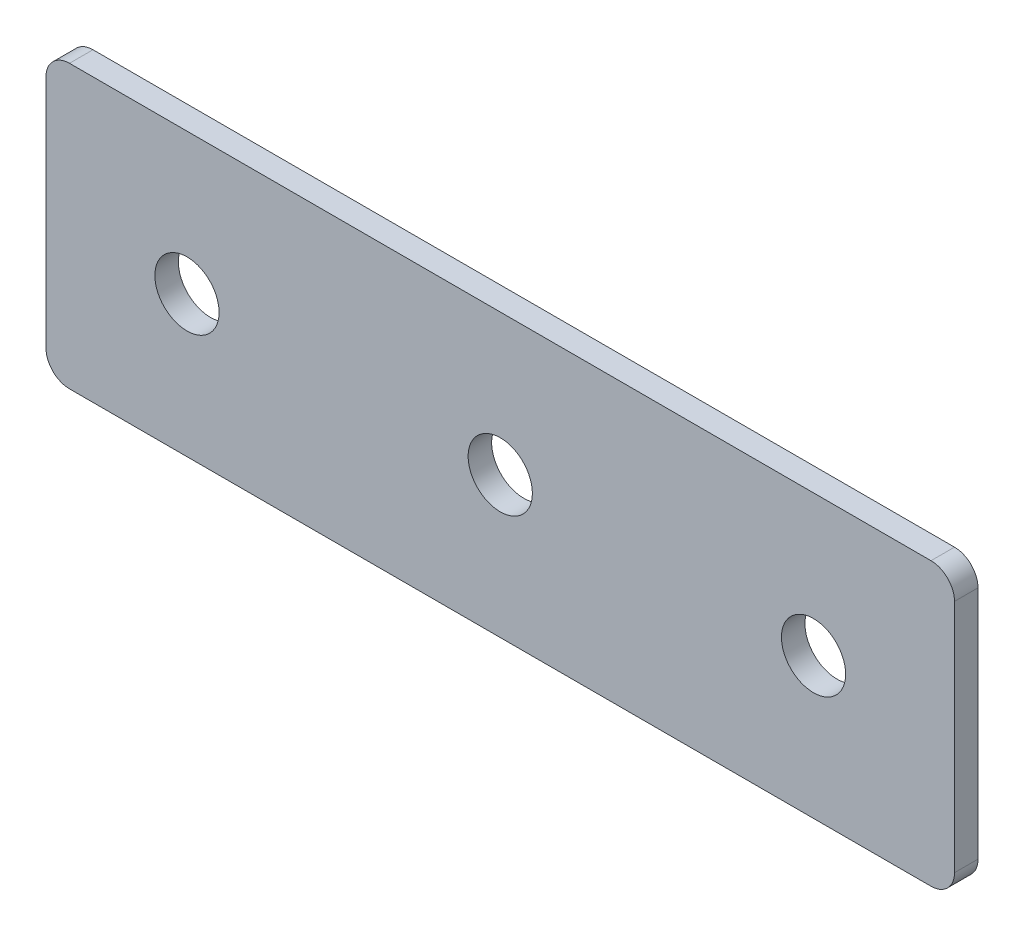
ISO-10303-21;
HEADER;
FILE_DESCRIPTION(('STEP AP214'),'2;1');
FILE_NAME('part.step','',(''),(''),'','','');
FILE_SCHEMA(('AUTOMOTIVE_DESIGN { 1 0 10303 214 1 1 1 1 }'));
ENDSEC;
DATA;
#1=APPLICATION_CONTEXT('core data for automotive mechanical design processes');
#2=APPLICATION_PROTOCOL_DEFINITION('international standard','automotive_design',2000,#1);
#3=PRODUCT_CONTEXT('',#1,'mechanical');
#4=PRODUCT('Part','Part','',(#3));
#5=PRODUCT_RELATED_PRODUCT_CATEGORY('part','',(#4));
#6=PRODUCT_DEFINITION_FORMATION('','',#4);
#7=PRODUCT_DEFINITION_CONTEXT('part definition',#1,'design');
#8=PRODUCT_DEFINITION('design','',#6,#7);
#9=PRODUCT_DEFINITION_SHAPE('','',#8);
#10=(LENGTH_UNIT() NAMED_UNIT(*) SI_UNIT(.MILLI.,.METRE.));
#11=(NAMED_UNIT(*) PLANE_ANGLE_UNIT() SI_UNIT($,.RADIAN.));
#12=(NAMED_UNIT(*) SI_UNIT($,.STERADIAN.) SOLID_ANGLE_UNIT());
#13=UNCERTAINTY_MEASURE_WITH_UNIT(LENGTH_MEASURE(1.E-05),#10,'distance_accuracy_value','');
#14=(GEOMETRIC_REPRESENTATION_CONTEXT(3) GLOBAL_UNCERTAINTY_ASSIGNED_CONTEXT((#13)) GLOBAL_UNIT_ASSIGNED_CONTEXT((#10,
#11,#12)) REPRESENTATION_CONTEXT('',''));
#15=CARTESIAN_POINT('',(0.,0.,0.));
#16=DIRECTION('',(0.,0.,1.));
#17=DIRECTION('',(1.,0.,0.));
#18=AXIS2_PLACEMENT_3D('',#15,#16,#17);
#19=CARTESIAN_POINT('',(0.,0.,3.));
#20=DIRECTION('',(0.,0.,-1.));
#21=DIRECTION('',(-1.,0.,0.));
#22=AXIS2_PLACEMENT_3D('',#19,#20,#21);
#23=PLANE('',#22);
#24=CARTESIAN_POINT('',(80.,0.,3.));
#25=DIRECTION('',(0.,0.,1.));
#26=DIRECTION('',(1.,0.,0.));
#27=AXIS2_PLACEMENT_3D('',#24,#25,#26);
#28=CIRCLE('',#27,4.1);
#29=CARTESIAN_POINT('',(84.1,0.,3.));
#30=VERTEX_POINT('',#29);
#31=EDGE_CURVE('E154',#30,#30,#28,.T.);
#32=ORIENTED_EDGE('',*,*,#31,.F.);
#33=EDGE_LOOP('',(#32));
#34=FACE_BOUND('',#33,.T.);
#35=CARTESIAN_POINT('',(40.,0.,3.));
#36=DIRECTION('',(0.,0.,1.));
#37=DIRECTION('',(1.,0.,0.));
#38=AXIS2_PLACEMENT_3D('',#35,#36,#37);
#39=CIRCLE('',#38,4.1);
#40=CARTESIAN_POINT('',(44.1,0.,3.));
#41=VERTEX_POINT('',#40);
#42=EDGE_CURVE('E160',#41,#41,#39,.T.);
#43=ORIENTED_EDGE('',*,*,#42,.F.);
#44=EDGE_LOOP('',(#43));
#45=FACE_BOUND('',#44,.T.);
#46=CARTESIAN_POINT('',(0.,0.,3.));
#47=DIRECTION('',(0.,0.,1.));
#48=DIRECTION('',(1.,0.,0.));
#49=AXIS2_PLACEMENT_3D('',#46,#47,#48);
#50=CIRCLE('',#49,4.1);
#51=CARTESIAN_POINT('',(4.1,0.,3.));
#52=VERTEX_POINT('',#51);
#53=EDGE_CURVE('E107',#52,#52,#50,.T.);
#54=ORIENTED_EDGE('',*,*,#53,.F.);
#55=EDGE_LOOP('',(#54));
#56=FACE_BOUND('',#55,.T.);
#57=DIRECTION('',(1.,0.,0.));
#58=VECTOR('',#57,1.);
#59=CARTESIAN_POINT('',(-18.,-18.,3.));
#60=LINE('',#59,#58);
#61=CARTESIAN_POINT('',(-15.,-18.,3.));
#62=VERTEX_POINT('',#61);
#63=CARTESIAN_POINT('',(95.,-18.,3.));
#64=VERTEX_POINT('',#63);
#65=EDGE_CURVE('E84',#62,#64,#60,.T.);
#66=ORIENTED_EDGE('',*,*,#65,.T.);
#67=CARTESIAN_POINT('',(95.,-15.,3.));
#68=DIRECTION('',(0.,0.,-1.));
#69=DIRECTION('',(-1.,0.,0.));
#70=AXIS2_PLACEMENT_3D('',#67,#68,#69);
#71=CIRCLE('',#70,3.);
#72=CARTESIAN_POINT('',(98.,-15.,3.));
#73=VERTEX_POINT('',#72);
#74=EDGE_CURVE('E91',#64,#73,#71,.F.);
#75=ORIENTED_EDGE('',*,*,#74,.T.);
#76=DIRECTION('',(0.,1.,0.));
#77=VECTOR('',#76,1.);
#78=CARTESIAN_POINT('',(98.,-18.,3.));
#79=LINE('',#78,#77);
#80=CARTESIAN_POINT('',(98.,15.,3.));
#81=VERTEX_POINT('',#80);
#82=EDGE_CURVE('E102',#73,#81,#79,.T.);
#83=ORIENTED_EDGE('',*,*,#82,.T.);
#84=CARTESIAN_POINT('',(95.,15.,3.));
#85=DIRECTION('',(0.,0.,-1.));
#86=DIRECTION('',(-1.,0.,0.));
#87=AXIS2_PLACEMENT_3D('',#84,#85,#86);
#88=CIRCLE('',#87,3.);
#89=CARTESIAN_POINT('',(95.,18.,3.));
#90=VERTEX_POINT('',#89);
#91=EDGE_CURVE('E109',#81,#90,#88,.F.);
#92=ORIENTED_EDGE('',*,*,#91,.T.);
#93=DIRECTION('',(-1.,0.,0.));
#94=VECTOR('',#93,1.);
#95=CARTESIAN_POINT('',(98.,18.,3.));
#96=LINE('',#95,#94);
#97=CARTESIAN_POINT('',(-15.,18.,3.));
#98=VERTEX_POINT('',#97);
#99=EDGE_CURVE('E139',#90,#98,#96,.T.);
#100=ORIENTED_EDGE('',*,*,#99,.T.);
#101=CARTESIAN_POINT('',(-15.,15.,3.));
#102=DIRECTION('',(0.,0.,-1.));
#103=DIRECTION('',(-1.,0.,0.));
#104=AXIS2_PLACEMENT_3D('',#101,#102,#103);
#105=CIRCLE('',#104,3.);
#106=CARTESIAN_POINT('',(-18.,15.,3.));
#107=VERTEX_POINT('',#106);
#108=EDGE_CURVE('E92',#98,#107,#105,.F.);
#109=ORIENTED_EDGE('',*,*,#108,.T.);
#110=DIRECTION('',(0.,-1.,0.));
#111=VECTOR('',#110,1.);
#112=CARTESIAN_POINT('',(-18.,18.,3.));
#113=LINE('',#112,#111);
#114=CARTESIAN_POINT('',(-18.,-15.,3.));
#115=VERTEX_POINT('',#114);
#116=EDGE_CURVE('E86',#107,#115,#113,.T.);
#117=ORIENTED_EDGE('',*,*,#116,.T.);
#118=CARTESIAN_POINT('',(-15.,-15.,3.));
#119=DIRECTION('',(0.,0.,-1.));
#120=DIRECTION('',(-1.,0.,0.));
#121=AXIS2_PLACEMENT_3D('',#118,#119,#120);
#122=CIRCLE('',#121,3.);
#123=EDGE_CURVE('E82',#115,#62,#122,.F.);
#124=ORIENTED_EDGE('',*,*,#123,.T.);
#125=EDGE_LOOP('',(#66,#75,#83,#92,#100,#109,#117,#124));
#126=FACE_BOUND('',#125,.T.);
#127=ADVANCED_FACE('F16',(#34,#45,#56,#126),#23,.F.);
#128=CARTESIAN_POINT('',(0.,0.,0.));
#129=DIRECTION('',(0.,0.,-1.));
#130=DIRECTION('',(-1.,0.,0.));
#131=AXIS2_PLACEMENT_3D('',#128,#129,#130);
#132=PLANE('',#131);
#133=CARTESIAN_POINT('',(80.,0.,0.));
#134=DIRECTION('',(0.,0.,1.));
#135=DIRECTION('',(1.,0.,0.));
#136=AXIS2_PLACEMENT_3D('',#133,#134,#135);
#137=CIRCLE('',#136,4.1);
#138=CARTESIAN_POINT('',(84.1,0.,0.));
#139=VERTEX_POINT('',#138);
#140=EDGE_CURVE('E150',#139,#139,#137,.T.);
#141=ORIENTED_EDGE('',*,*,#140,.T.);
#142=EDGE_LOOP('',(#141));
#143=FACE_BOUND('',#142,.T.);
#144=CARTESIAN_POINT('',(40.,0.,0.));
#145=DIRECTION('',(0.,0.,1.));
#146=DIRECTION('',(1.,0.,0.));
#147=AXIS2_PLACEMENT_3D('',#144,#145,#146);
#148=CIRCLE('',#147,4.1);
#149=CARTESIAN_POINT('',(44.1,0.,0.));
#150=VERTEX_POINT('',#149);
#151=EDGE_CURVE('E157',#150,#150,#148,.T.);
#152=ORIENTED_EDGE('',*,*,#151,.T.);
#153=EDGE_LOOP('',(#152));
#154=FACE_BOUND('',#153,.T.);
#155=CARTESIAN_POINT('',(0.,0.,0.));
#156=DIRECTION('',(0.,0.,1.));
#157=DIRECTION('',(1.,0.,0.));
#158=AXIS2_PLACEMENT_3D('',#155,#156,#157);
#159=CIRCLE('',#158,4.1);
#160=CARTESIAN_POINT('',(4.1,0.,0.));
#161=VERTEX_POINT('',#160);
#162=EDGE_CURVE('E112',#161,#161,#159,.T.);
#163=ORIENTED_EDGE('',*,*,#162,.T.);
#164=EDGE_LOOP('',(#163));
#165=FACE_BOUND('',#164,.T.);
#166=DIRECTION('',(0.,1.,0.));
#167=VECTOR('',#166,1.);
#168=CARTESIAN_POINT('',(98.,-18.,0.));
#169=LINE('',#168,#167);
#170=CARTESIAN_POINT('',(98.,-15.,0.));
#171=VERTEX_POINT('',#170);
#172=CARTESIAN_POINT('',(98.,15.,0.));
#173=VERTEX_POINT('',#172);
#174=EDGE_CURVE('E141',#171,#173,#169,.T.);
#175=ORIENTED_EDGE('',*,*,#174,.F.);
#176=CARTESIAN_POINT('',(95.,-15.,0.));
#177=DIRECTION('',(0.,0.,-1.));
#178=DIRECTION('',(-1.,0.,0.));
#179=AXIS2_PLACEMENT_3D('',#176,#177,#178);
#180=CIRCLE('',#179,3.);
#181=CARTESIAN_POINT('',(95.,-18.,0.));
#182=VERTEX_POINT('',#181);
#183=EDGE_CURVE('E128',#171,#182,#180,.T.);
#184=ORIENTED_EDGE('',*,*,#183,.T.);
#185=DIRECTION('',(1.,0.,0.));
#186=VECTOR('',#185,1.);
#187=CARTESIAN_POINT('',(-18.,-18.,0.));
#188=LINE('',#187,#186);
#189=CARTESIAN_POINT('',(-15.,-18.,0.));
#190=VERTEX_POINT('',#189);
#191=EDGE_CURVE('E138',#190,#182,#188,.T.);
#192=ORIENTED_EDGE('',*,*,#191,.F.);
#193=CARTESIAN_POINT('',(-15.,-15.,0.));
#194=DIRECTION('',(0.,0.,-1.));
#195=DIRECTION('',(-1.,0.,0.));
#196=AXIS2_PLACEMENT_3D('',#193,#194,#195);
#197=CIRCLE('',#196,3.);
#198=CARTESIAN_POINT('',(-18.,-15.,0.));
#199=VERTEX_POINT('',#198);
#200=EDGE_CURVE('E106',#190,#199,#197,.T.);
#201=ORIENTED_EDGE('',*,*,#200,.T.);
#202=DIRECTION('',(0.,-1.,0.));
#203=VECTOR('',#202,1.);
#204=CARTESIAN_POINT('',(-18.,18.,0.));
#205=LINE('',#204,#203);
#206=CARTESIAN_POINT('',(-18.,15.,0.));
#207=VERTEX_POINT('',#206);
#208=EDGE_CURVE('E137',#207,#199,#205,.T.);
#209=ORIENTED_EDGE('',*,*,#208,.F.);
#210=CARTESIAN_POINT('',(-15.,15.,0.));
#211=DIRECTION('',(0.,0.,-1.));
#212=DIRECTION('',(-1.,0.,0.));
#213=AXIS2_PLACEMENT_3D('',#210,#211,#212);
#214=CIRCLE('',#213,3.);
#215=CARTESIAN_POINT('',(-15.,18.,0.));
#216=VERTEX_POINT('',#215);
#217=EDGE_CURVE('E31',#207,#216,#214,.T.);
#218=ORIENTED_EDGE('',*,*,#217,.T.);
#219=DIRECTION('',(-1.,0.,0.));
#220=VECTOR('',#219,1.);
#221=CARTESIAN_POINT('',(98.,18.,0.));
#222=LINE('',#221,#220);
#223=CARTESIAN_POINT('',(95.,18.,0.));
#224=VERTEX_POINT('',#223);
#225=EDGE_CURVE('E148',#224,#216,#222,.T.);
#226=ORIENTED_EDGE('',*,*,#225,.F.);
#227=CARTESIAN_POINT('',(95.,15.,0.));
#228=DIRECTION('',(0.,0.,-1.));
#229=DIRECTION('',(-1.,0.,0.));
#230=AXIS2_PLACEMENT_3D('',#227,#228,#229);
#231=CIRCLE('',#230,3.);
#232=EDGE_CURVE('E124',#224,#173,#231,.T.);
#233=ORIENTED_EDGE('',*,*,#232,.T.);
#234=EDGE_LOOP('',(#175,#184,#192,#201,#209,#218,#226,#233));
#235=FACE_BOUND('',#234,.T.);
#236=ADVANCED_FACE('F166',(#143,#154,#165,#235),#132,.T.);
#237=CARTESIAN_POINT('',(0.,0.,3.));
#238=DIRECTION('',(0.,0.,-1.));
#239=DIRECTION('',(-1.,0.,0.));
#240=AXIS2_PLACEMENT_3D('',#237,#238,#239);
#241=CYLINDRICAL_SURFACE('',#240,4.1);
#242=ORIENTED_EDGE('',*,*,#53,.T.);
#243=EDGE_LOOP('',(#242));
#244=FACE_BOUND('',#243,.T.);
#245=ORIENTED_EDGE('',*,*,#162,.F.);
#246=EDGE_LOOP('',(#245));
#247=FACE_BOUND('',#246,.T.);
#248=ADVANCED_FACE('F172',(#244,#247),#241,.F.);
#249=CARTESIAN_POINT('',(40.,0.,3.));
#250=DIRECTION('',(0.,0.,-1.));
#251=DIRECTION('',(-1.,0.,0.));
#252=AXIS2_PLACEMENT_3D('',#249,#250,#251);
#253=CYLINDRICAL_SURFACE('',#252,4.1);
#254=ORIENTED_EDGE('',*,*,#42,.T.);
#255=EDGE_LOOP('',(#254));
#256=FACE_BOUND('',#255,.T.);
#257=ORIENTED_EDGE('',*,*,#151,.F.);
#258=EDGE_LOOP('',(#257));
#259=FACE_BOUND('',#258,.T.);
#260=ADVANCED_FACE('F169',(#256,#259),#253,.F.);
#261=CARTESIAN_POINT('',(80.,0.,3.));
#262=DIRECTION('',(0.,0.,-1.));
#263=DIRECTION('',(-1.,0.,0.));
#264=AXIS2_PLACEMENT_3D('',#261,#262,#263);
#265=CYLINDRICAL_SURFACE('',#264,4.1);
#266=ORIENTED_EDGE('',*,*,#31,.T.);
#267=EDGE_LOOP('',(#266));
#268=FACE_BOUND('',#267,.T.);
#269=ORIENTED_EDGE('',*,*,#140,.F.);
#270=EDGE_LOOP('',(#269));
#271=FACE_BOUND('',#270,.T.);
#272=ADVANCED_FACE('F171',(#268,#271),#265,.F.);
#273=CARTESIAN_POINT('',(-18.,18.,0.));
#274=DIRECTION('',(-1.,0.,0.));
#275=DIRECTION('',(0.,0.,1.));
#276=AXIS2_PLACEMENT_3D('',#273,#274,#275);
#277=PLANE('',#276);
#278=ORIENTED_EDGE('',*,*,#208,.T.);
#279=DIRECTION('',(0.,0.,1.));
#280=VECTOR('',#279,1.);
#281=CARTESIAN_POINT('',(-18.,-15.,0.));
#282=LINE('',#281,#280);
#283=EDGE_CURVE('E132',#199,#115,#282,.T.);
#284=ORIENTED_EDGE('',*,*,#283,.T.);
#285=ORIENTED_EDGE('',*,*,#116,.F.);
#286=DIRECTION('',(0.,0.,1.));
#287=VECTOR('',#286,1.);
#288=CARTESIAN_POINT('',(-18.,15.,0.));
#289=LINE('',#288,#287);
#290=EDGE_CURVE('E130',#107,#207,#289,.F.);
#291=ORIENTED_EDGE('',*,*,#290,.T.);
#292=EDGE_LOOP('',(#278,#284,#285,#291));
#293=FACE_BOUND('',#292,.T.);
#294=ADVANCED_FACE('F135',(#293),#277,.T.);
#295=CARTESIAN_POINT('',(98.,18.,0.));
#296=DIRECTION('',(0.,1.,0.));
#297=DIRECTION('',(0.,0.,1.));
#298=AXIS2_PLACEMENT_3D('',#295,#296,#297);
#299=PLANE('',#298);
#300=ORIENTED_EDGE('',*,*,#225,.T.);
#301=DIRECTION('',(0.,0.,1.));
#302=VECTOR('',#301,1.);
#303=CARTESIAN_POINT('',(-15.,18.,0.));
#304=LINE('',#303,#302);
#305=EDGE_CURVE('E10',#216,#98,#304,.T.);
#306=ORIENTED_EDGE('',*,*,#305,.T.);
#307=ORIENTED_EDGE('',*,*,#99,.F.);
#308=DIRECTION('',(0.,0.,1.));
#309=VECTOR('',#308,1.);
#310=CARTESIAN_POINT('',(95.,18.,0.));
#311=LINE('',#310,#309);
#312=EDGE_CURVE('E24',#90,#224,#311,.F.);
#313=ORIENTED_EDGE('',*,*,#312,.T.);
#314=EDGE_LOOP('',(#300,#306,#307,#313));
#315=FACE_BOUND('',#314,.T.);
#316=ADVANCED_FACE('F208',(#315),#299,.T.);
#317=CARTESIAN_POINT('',(98.,-18.,0.));
#318=DIRECTION('',(1.,0.,0.));
#319=DIRECTION('',(0.,0.,-1.));
#320=AXIS2_PLACEMENT_3D('',#317,#318,#319);
#321=PLANE('',#320);
#322=ORIENTED_EDGE('',*,*,#82,.F.);
#323=DIRECTION('',(0.,0.,1.));
#324=VECTOR('',#323,1.);
#325=CARTESIAN_POINT('',(98.,-15.,0.));
#326=LINE('',#325,#324);
#327=EDGE_CURVE('E122',#73,#171,#326,.F.);
#328=ORIENTED_EDGE('',*,*,#327,.T.);
#329=ORIENTED_EDGE('',*,*,#174,.T.);
#330=DIRECTION('',(0.,0.,1.));
#331=VECTOR('',#330,1.);
#332=CARTESIAN_POINT('',(98.,15.,0.));
#333=LINE('',#332,#331);
#334=EDGE_CURVE('E119',#173,#81,#333,.T.);
#335=ORIENTED_EDGE('',*,*,#334,.T.);
#336=EDGE_LOOP('',(#322,#328,#329,#335));
#337=FACE_BOUND('',#336,.T.);
#338=ADVANCED_FACE('F213',(#337),#321,.T.);
#339=CARTESIAN_POINT('',(-18.,-18.,0.));
#340=DIRECTION('',(0.,-1.,0.));
#341=DIRECTION('',(0.,0.,-1.));
#342=AXIS2_PLACEMENT_3D('',#339,#340,#341);
#343=PLANE('',#342);
#344=ORIENTED_EDGE('',*,*,#191,.T.);
#345=DIRECTION('',(0.,0.,1.));
#346=VECTOR('',#345,1.);
#347=CARTESIAN_POINT('',(95.,-18.,0.));
#348=LINE('',#347,#346);
#349=EDGE_CURVE('E101',#182,#64,#348,.T.);
#350=ORIENTED_EDGE('',*,*,#349,.T.);
#351=ORIENTED_EDGE('',*,*,#65,.F.);
#352=DIRECTION('',(0.,0.,1.));
#353=VECTOR('',#352,1.);
#354=CARTESIAN_POINT('',(-15.,-18.,0.));
#355=LINE('',#354,#353);
#356=EDGE_CURVE('E98',#62,#190,#355,.F.);
#357=ORIENTED_EDGE('',*,*,#356,.T.);
#358=EDGE_LOOP('',(#344,#350,#351,#357));
#359=FACE_BOUND('',#358,.T.);
#360=ADVANCED_FACE('F97',(#359),#343,.T.);
#361=CARTESIAN_POINT('',(95.,-15.,0.));
#362=DIRECTION('',(0.,0.,1.));
#363=DIRECTION('',(1.,0.,0.));
#364=AXIS2_PLACEMENT_3D('',#361,#362,#363);
#365=CYLINDRICAL_SURFACE('',#364,3.);
#366=ORIENTED_EDGE('',*,*,#183,.F.);
#367=ORIENTED_EDGE('',*,*,#327,.F.);
#368=ORIENTED_EDGE('',*,*,#74,.F.);
#369=ORIENTED_EDGE('',*,*,#349,.F.);
#370=EDGE_LOOP('',(#366,#367,#368,#369));
#371=FACE_BOUND('',#370,.T.);
#372=ADVANCED_FACE('F195',(#371),#365,.T.);
#373=CARTESIAN_POINT('',(-15.,-15.,0.));
#374=DIRECTION('',(0.,0.,1.));
#375=DIRECTION('',(1.,0.,0.));
#376=AXIS2_PLACEMENT_3D('',#373,#374,#375);
#377=CYLINDRICAL_SURFACE('',#376,3.);
#378=ORIENTED_EDGE('',*,*,#200,.F.);
#379=ORIENTED_EDGE('',*,*,#356,.F.);
#380=ORIENTED_EDGE('',*,*,#123,.F.);
#381=ORIENTED_EDGE('',*,*,#283,.F.);
#382=EDGE_LOOP('',(#378,#379,#380,#381));
#383=FACE_BOUND('',#382,.T.);
#384=ADVANCED_FACE('F105',(#383),#377,.T.);
#385=CARTESIAN_POINT('',(-15.,15.,0.));
#386=DIRECTION('',(0.,0.,1.));
#387=DIRECTION('',(1.,0.,0.));
#388=AXIS2_PLACEMENT_3D('',#385,#386,#387);
#389=CYLINDRICAL_SURFACE('',#388,3.);
#390=ORIENTED_EDGE('',*,*,#217,.F.);
#391=ORIENTED_EDGE('',*,*,#290,.F.);
#392=ORIENTED_EDGE('',*,*,#108,.F.);
#393=ORIENTED_EDGE('',*,*,#305,.F.);
#394=EDGE_LOOP('',(#390,#391,#392,#393));
#395=FACE_BOUND('',#394,.T.);
#396=ADVANCED_FACE('F200',(#395),#389,.T.);
#397=CARTESIAN_POINT('',(95.,15.,0.));
#398=DIRECTION('',(0.,0.,1.));
#399=DIRECTION('',(1.,0.,0.));
#400=AXIS2_PLACEMENT_3D('',#397,#398,#399);
#401=CYLINDRICAL_SURFACE('',#400,3.);
#402=ORIENTED_EDGE('',*,*,#232,.F.);
#403=ORIENTED_EDGE('',*,*,#312,.F.);
#404=ORIENTED_EDGE('',*,*,#91,.F.);
#405=ORIENTED_EDGE('',*,*,#334,.F.);
#406=EDGE_LOOP('',(#402,#403,#404,#405));
#407=FACE_BOUND('',#406,.T.);
#408=ADVANCED_FACE('F18',(#407),#401,.T.);
#409=CLOSED_SHELL('',(#127,#236,#248,#260,#272,#294,#316,#338,#360,#372,#384,#396,#408));
#410=MANIFOLD_SOLID_BREP('B1',#409);
#411=ADVANCED_BREP_SHAPE_REPRESENTATION('',(#18,#410),#14);
#412=SHAPE_DEFINITION_REPRESENTATION(#9,#411);
ENDSEC;
END-ISO-10303-21;
